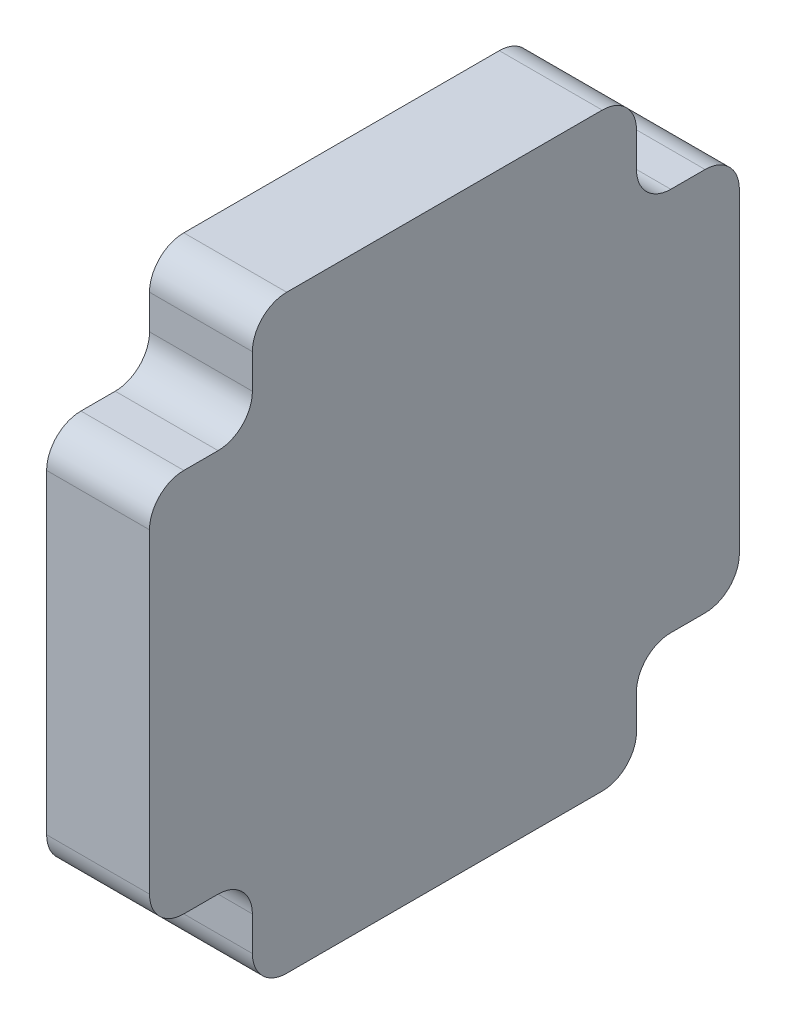
ISO-10303-21;
HEADER;
FILE_DESCRIPTION(('STEP AP214'),'2;1');
FILE_NAME('part.step','',(''),(''),'','','');
FILE_SCHEMA(('AUTOMOTIVE_DESIGN { 1 0 10303 214 1 1 1 1 }'));
ENDSEC;
DATA;
#1=APPLICATION_CONTEXT('core data for automotive mechanical design processes');
#2=APPLICATION_PROTOCOL_DEFINITION('international standard','automotive_design',2000,#1);
#3=PRODUCT_CONTEXT('',#1,'mechanical');
#4=PRODUCT('Part','Part','',(#3));
#5=PRODUCT_RELATED_PRODUCT_CATEGORY('part','',(#4));
#6=PRODUCT_DEFINITION_FORMATION('','',#4);
#7=PRODUCT_DEFINITION_CONTEXT('part definition',#1,'design');
#8=PRODUCT_DEFINITION('design','',#6,#7);
#9=PRODUCT_DEFINITION_SHAPE('','',#8);
#10=(LENGTH_UNIT() NAMED_UNIT(*) SI_UNIT(.MILLI.,.METRE.));
#11=(NAMED_UNIT(*) PLANE_ANGLE_UNIT() SI_UNIT($,.RADIAN.));
#12=(NAMED_UNIT(*) SI_UNIT($,.STERADIAN.) SOLID_ANGLE_UNIT());
#13=UNCERTAINTY_MEASURE_WITH_UNIT(LENGTH_MEASURE(1.E-05),#10,'distance_accuracy_value','');
#14=(GEOMETRIC_REPRESENTATION_CONTEXT(3) GLOBAL_UNCERTAINTY_ASSIGNED_CONTEXT((#13)) GLOBAL_UNIT_ASSIGNED_CONTEXT((#10,
#11,#12)) REPRESENTATION_CONTEXT('',''));
#15=CARTESIAN_POINT('',(0.,0.,0.));
#16=DIRECTION('',(0.,0.,1.));
#17=DIRECTION('',(1.,0.,0.));
#18=AXIS2_PLACEMENT_3D('',#15,#16,#17);
#19=CARTESIAN_POINT('',(15.,20.,-4.99999999999995));
#20=DIRECTION('',(-1.,0.,0.));
#21=DIRECTION('',(0.,0.,1.));
#22=AXIS2_PLACEMENT_3D('',#19,#20,#21);
#23=CYLINDRICAL_SURFACE('',#22,5.);
#24=CARTESIAN_POINT('',(0.,20.,-4.99999999999995));
#25=DIRECTION('',(1.,0.,0.));
#26=DIRECTION('',(0.,0.,1.));
#27=AXIS2_PLACEMENT_3D('',#24,#25,#26);
#28=CIRCLE('',#27,5.);
#29=CARTESIAN_POINT('',(0.,20.0000000000001,0.));
#30=VERTEX_POINT('',#29);
#31=CARTESIAN_POINT('',(0.,15.,-4.99999999999998));
#32=VERTEX_POINT('',#31);
#33=EDGE_CURVE('E224',#30,#32,#28,.T.);
#34=ORIENTED_EDGE('',*,*,#33,.T.);
#35=DIRECTION('',(-1.,0.,0.));
#36=VECTOR('',#35,1.);
#37=CARTESIAN_POINT('',(15.,15.,-4.99999999999998));
#38=LINE('',#37,#36);
#39=CARTESIAN_POINT('',(15.,15.,-4.99999999999998));
#40=VERTEX_POINT('',#39);
#41=EDGE_CURVE('E11',#40,#32,#38,.T.);
#42=ORIENTED_EDGE('',*,*,#41,.F.);
#43=CARTESIAN_POINT('',(15.,20.,-4.99999999999995));
#44=DIRECTION('',(1.,0.,0.));
#45=DIRECTION('',(0.,0.,1.));
#46=AXIS2_PLACEMENT_3D('',#43,#44,#45);
#47=CIRCLE('',#46,5.);
#48=CARTESIAN_POINT('',(15.,20.0000000000001,0.));
#49=VERTEX_POINT('',#48);
#50=EDGE_CURVE('E270',#49,#40,#47,.T.);
#51=ORIENTED_EDGE('',*,*,#50,.F.);
#52=DIRECTION('',(-1.,0.,0.));
#53=VECTOR('',#52,1.);
#54=CARTESIAN_POINT('',(15.,20.0000000000001,0.));
#55=LINE('',#54,#53);
#56=EDGE_CURVE('E220',#49,#30,#55,.T.);
#57=ORIENTED_EDGE('',*,*,#56,.T.);
#58=EDGE_LOOP('',(#34,#42,#51,#57));
#59=FACE_BOUND('',#58,.T.);
#60=ADVANCED_FACE('F32',(#59),#23,.T.);
#61=CARTESIAN_POINT('',(15.,15.,-4.99999999999998));
#62=DIRECTION('',(0.,1.,0.));
#63=DIRECTION('',(0.,0.,1.));
#64=AXIS2_PLACEMENT_3D('',#61,#62,#63);
#65=PLANE('',#64);
#66=DIRECTION('',(0.,0.,-1.));
#67=VECTOR('',#66,1.);
#68=CARTESIAN_POINT('',(0.,15.,-4.99999999999998));
#69=LINE('',#68,#67);
#70=CARTESIAN_POINT('',(0.,15.,-9.99999999999995));
#71=VERTEX_POINT('',#70);
#72=EDGE_CURVE('E227',#32,#71,#69,.T.);
#73=ORIENTED_EDGE('',*,*,#72,.T.);
#74=DIRECTION('',(-1.,0.,0.));
#75=VECTOR('',#74,1.);
#76=CARTESIAN_POINT('',(15.,15.,-9.99999999999995));
#77=LINE('',#76,#75);
#78=CARTESIAN_POINT('',(15.,15.,-9.99999999999995));
#79=VERTEX_POINT('',#78);
#80=EDGE_CURVE('E40',#79,#71,#77,.T.);
#81=ORIENTED_EDGE('',*,*,#80,.F.);
#82=DIRECTION('',(0.,0.,-1.));
#83=VECTOR('',#82,1.);
#84=CARTESIAN_POINT('',(15.,15.,-4.99999999999998));
#85=LINE('',#84,#83);
#86=EDGE_CURVE('E139',#40,#79,#85,.T.);
#87=ORIENTED_EDGE('',*,*,#86,.F.);
#88=ORIENTED_EDGE('',*,*,#41,.T.);
#89=EDGE_LOOP('',(#73,#81,#87,#88));
#90=FACE_BOUND('',#89,.T.);
#91=ADVANCED_FACE('F408',(#90),#65,.F.);
#92=CARTESIAN_POINT('',(15.,10.,-9.99999999999998));
#93=DIRECTION('',(-1.,0.,0.));
#94=DIRECTION('',(0.,0.,1.));
#95=AXIS2_PLACEMENT_3D('',#92,#93,#94);
#96=CYLINDRICAL_SURFACE('',#95,5.);
#97=CARTESIAN_POINT('',(0.,10.,-9.99999999999998));
#98=DIRECTION('',(-1.,0.,0.));
#99=DIRECTION('',(0.,0.,-1.));
#100=AXIS2_PLACEMENT_3D('',#97,#98,#99);
#101=CIRCLE('',#100,5.);
#102=CARTESIAN_POINT('',(0.,10.,-15.));
#103=VERTEX_POINT('',#102);
#104=EDGE_CURVE('E229',#71,#103,#101,.T.);
#105=ORIENTED_EDGE('',*,*,#104,.T.);
#106=DIRECTION('',(-1.,0.,0.));
#107=VECTOR('',#106,1.);
#108=CARTESIAN_POINT('',(15.,10.,-15.));
#109=LINE('',#108,#107);
#110=CARTESIAN_POINT('',(15.,10.,-15.));
#111=VERTEX_POINT('',#110);
#112=EDGE_CURVE('E325',#111,#103,#109,.T.);
#113=ORIENTED_EDGE('',*,*,#112,.F.);
#114=CARTESIAN_POINT('',(15.,10.,-9.99999999999998));
#115=DIRECTION('',(-1.,0.,0.));
#116=DIRECTION('',(0.,0.,-1.));
#117=AXIS2_PLACEMENT_3D('',#114,#115,#116);
#118=CIRCLE('',#117,5.);
#119=EDGE_CURVE('E333',#79,#111,#118,.T.);
#120=ORIENTED_EDGE('',*,*,#119,.F.);
#121=ORIENTED_EDGE('',*,*,#80,.T.);
#122=EDGE_LOOP('',(#105,#113,#120,#121));
#123=FACE_BOUND('',#122,.T.);
#124=ADVANCED_FACE('F331',(#123),#96,.F.);
#125=CARTESIAN_POINT('',(15.,10.,-15.));
#126=DIRECTION('',(0.,0.,-1.));
#127=DIRECTION('',(0.,1.,0.));
#128=AXIS2_PLACEMENT_3D('',#125,#126,#127);
#129=PLANE('',#128);
#130=DIRECTION('',(0.,-1.,0.));
#131=VECTOR('',#130,1.);
#132=CARTESIAN_POINT('',(0.,10.,-15.));
#133=LINE('',#132,#131);
#134=CARTESIAN_POINT('',(0.,5.00000000000005,-15.));
#135=VERTEX_POINT('',#134);
#136=EDGE_CURVE('E231',#103,#135,#133,.T.);
#137=ORIENTED_EDGE('',*,*,#136,.T.);
#138=DIRECTION('',(-1.,0.,0.));
#139=VECTOR('',#138,1.);
#140=CARTESIAN_POINT('',(15.,5.00000000000005,-15.));
#141=LINE('',#140,#139);
#142=CARTESIAN_POINT('',(15.,5.00000000000005,-15.));
#143=VERTEX_POINT('',#142);
#144=EDGE_CURVE('E322',#143,#135,#141,.T.);
#145=ORIENTED_EDGE('',*,*,#144,.F.);
#146=DIRECTION('',(0.,-1.,0.));
#147=VECTOR('',#146,1.);
#148=CARTESIAN_POINT('',(15.,10.,-15.));
#149=LINE('',#148,#147);
#150=EDGE_CURVE('E351',#111,#143,#149,.T.);
#151=ORIENTED_EDGE('',*,*,#150,.F.);
#152=ORIENTED_EDGE('',*,*,#112,.T.);
#153=EDGE_LOOP('',(#137,#145,#151,#152));
#154=FACE_BOUND('',#153,.T.);
#155=ADVANCED_FACE('F342',(#154),#129,.F.);
#156=CARTESIAN_POINT('',(15.,5.00000000000001,-20.));
#157=DIRECTION('',(-1.,0.,0.));
#158=DIRECTION('',(0.,0.,1.));
#159=AXIS2_PLACEMENT_3D('',#156,#157,#158);
#160=CYLINDRICAL_SURFACE('',#159,5.);
#161=CARTESIAN_POINT('',(0.,5.00000000000001,-20.));
#162=DIRECTION('',(1.,0.,0.));
#163=DIRECTION('',(0.,0.,-1.));
#164=AXIS2_PLACEMENT_3D('',#161,#162,#163);
#165=CIRCLE('',#164,5.);
#166=CARTESIAN_POINT('',(0.,0.,-20.));
#167=VERTEX_POINT('',#166);
#168=EDGE_CURVE('E233',#135,#167,#165,.T.);
#169=ORIENTED_EDGE('',*,*,#168,.T.);
#170=DIRECTION('',(-1.,0.,0.));
#171=VECTOR('',#170,1.);
#172=CARTESIAN_POINT('',(15.,0.,-20.));
#173=LINE('',#172,#171);
#174=CARTESIAN_POINT('',(15.,0.,-20.));
#175=VERTEX_POINT('',#174);
#176=EDGE_CURVE('E319',#175,#167,#173,.T.);
#177=ORIENTED_EDGE('',*,*,#176,.F.);
#178=CARTESIAN_POINT('',(15.,5.00000000000001,-20.));
#179=DIRECTION('',(1.,0.,0.));
#180=DIRECTION('',(0.,0.,-1.));
#181=AXIS2_PLACEMENT_3D('',#178,#179,#180);
#182=CIRCLE('',#181,5.);
#183=EDGE_CURVE('E348',#143,#175,#182,.T.);
#184=ORIENTED_EDGE('',*,*,#183,.F.);
#185=ORIENTED_EDGE('',*,*,#144,.T.);
#186=EDGE_LOOP('',(#169,#177,#184,#185));
#187=FACE_BOUND('',#186,.T.);
#188=ADVANCED_FACE('F346',(#187),#160,.T.);
#189=CARTESIAN_POINT('',(15.,0.,-20.));
#190=DIRECTION('',(0.,1.,0.));
#191=DIRECTION('',(0.,0.,1.));
#192=AXIS2_PLACEMENT_3D('',#189,#190,#191);
#193=PLANE('',#192);
#194=DIRECTION('',(0.,0.,-1.));
#195=VECTOR('',#194,1.);
#196=CARTESIAN_POINT('',(0.,0.,-20.));
#197=LINE('',#196,#195);
#198=CARTESIAN_POINT('',(0.,0.,-65.9999999999999));
#199=VERTEX_POINT('',#198);
#200=EDGE_CURVE('E235',#167,#199,#197,.T.);
#201=ORIENTED_EDGE('',*,*,#200,.T.);
#202=DIRECTION('',(-1.,0.,0.));
#203=VECTOR('',#202,1.);
#204=CARTESIAN_POINT('',(15.,0.,-65.9999999999999));
#205=LINE('',#204,#203);
#206=CARTESIAN_POINT('',(15.,0.,-65.9999999999999));
#207=VERTEX_POINT('',#206);
#208=EDGE_CURVE('E316',#207,#199,#205,.T.);
#209=ORIENTED_EDGE('',*,*,#208,.F.);
#210=DIRECTION('',(0.,0.,-1.));
#211=VECTOR('',#210,1.);
#212=CARTESIAN_POINT('',(15.,0.,-20.));
#213=LINE('',#212,#211);
#214=EDGE_CURVE('E350',#175,#207,#213,.T.);
#215=ORIENTED_EDGE('',*,*,#214,.F.);
#216=ORIENTED_EDGE('',*,*,#176,.T.);
#217=EDGE_LOOP('',(#201,#209,#215,#216));
#218=FACE_BOUND('',#217,.T.);
#219=ADVANCED_FACE('F421',(#218),#193,.F.);
#220=CARTESIAN_POINT('',(15.,4.99999999999999,-66.));
#221=DIRECTION('',(-1.,0.,0.));
#222=DIRECTION('',(0.,0.,1.));
#223=AXIS2_PLACEMENT_3D('',#220,#221,#222);
#224=CYLINDRICAL_SURFACE('',#223,5.);
#225=CARTESIAN_POINT('',(0.,4.99999999999999,-66.));
#226=DIRECTION('',(1.,0.,0.));
#227=DIRECTION('',(0.,0.,1.));
#228=AXIS2_PLACEMENT_3D('',#225,#226,#227);
#229=CIRCLE('',#228,5.);
#230=CARTESIAN_POINT('',(0.,5.00000000000002,-71.));
#231=VERTEX_POINT('',#230);
#232=EDGE_CURVE('E237',#199,#231,#229,.T.);
#233=ORIENTED_EDGE('',*,*,#232,.T.);
#234=DIRECTION('',(-1.,0.,0.));
#235=VECTOR('',#234,1.);
#236=CARTESIAN_POINT('',(15.,5.00000000000002,-71.));
#237=LINE('',#236,#235);
#238=CARTESIAN_POINT('',(15.,5.00000000000002,-71.));
#239=VERTEX_POINT('',#238);
#240=EDGE_CURVE('E313',#239,#231,#237,.T.);
#241=ORIENTED_EDGE('',*,*,#240,.F.);
#242=CARTESIAN_POINT('',(15.,4.99999999999999,-66.));
#243=DIRECTION('',(1.,0.,0.));
#244=DIRECTION('',(0.,0.,1.));
#245=AXIS2_PLACEMENT_3D('',#242,#243,#244);
#246=CIRCLE('',#245,5.);
#247=EDGE_CURVE('E353',#207,#239,#246,.T.);
#248=ORIENTED_EDGE('',*,*,#247,.F.);
#249=ORIENTED_EDGE('',*,*,#208,.T.);
#250=EDGE_LOOP('',(#233,#241,#248,#249));
#251=FACE_BOUND('',#250,.T.);
#252=ADVANCED_FACE('F424',(#251),#224,.T.);
#253=CARTESIAN_POINT('',(15.,5.00000000000002,-71.));
#254=DIRECTION('',(0.,0.,1.));
#255=DIRECTION('',(1.,0.,0.));
#256=AXIS2_PLACEMENT_3D('',#253,#254,#255);
#257=PLANE('',#256);
#258=DIRECTION('',(0.,1.,0.));
#259=VECTOR('',#258,1.);
#260=CARTESIAN_POINT('',(0.,5.00000000000002,-71.));
#261=LINE('',#260,#259);
#262=CARTESIAN_POINT('',(0.,9.99999999999995,-71.));
#263=VERTEX_POINT('',#262);
#264=EDGE_CURVE('E239',#231,#263,#261,.T.);
#265=ORIENTED_EDGE('',*,*,#264,.T.);
#266=DIRECTION('',(-1.,0.,0.));
#267=VECTOR('',#266,1.);
#268=CARTESIAN_POINT('',(15.,9.99999999999995,-71.));
#269=LINE('',#268,#267);
#270=CARTESIAN_POINT('',(15.,9.99999999999995,-71.));
#271=VERTEX_POINT('',#270);
#272=EDGE_CURVE('E310',#271,#263,#269,.T.);
#273=ORIENTED_EDGE('',*,*,#272,.F.);
#274=DIRECTION('',(0.,1.,0.));
#275=VECTOR('',#274,1.);
#276=CARTESIAN_POINT('',(15.,5.00000000000002,-71.));
#277=LINE('',#276,#275);
#278=EDGE_CURVE('E359',#239,#271,#277,.T.);
#279=ORIENTED_EDGE('',*,*,#278,.F.);
#280=ORIENTED_EDGE('',*,*,#240,.T.);
#281=EDGE_LOOP('',(#265,#273,#279,#280));
#282=FACE_BOUND('',#281,.T.);
#283=ADVANCED_FACE('F428',(#282),#257,.F.);
#284=CARTESIAN_POINT('',(15.,9.99999999999999,-76.));
#285=DIRECTION('',(-1.,0.,0.));
#286=DIRECTION('',(0.,0.,1.));
#287=AXIS2_PLACEMENT_3D('',#284,#285,#286);
#288=CYLINDRICAL_SURFACE('',#287,5.);
#289=CARTESIAN_POINT('',(0.,9.99999999999999,-76.));
#290=DIRECTION('',(-1.,0.,0.));
#291=DIRECTION('',(0.,0.,-1.));
#292=AXIS2_PLACEMENT_3D('',#289,#290,#291);
#293=CIRCLE('',#292,5.);
#294=CARTESIAN_POINT('',(0.,15.,-76.));
#295=VERTEX_POINT('',#294);
#296=EDGE_CURVE('E241',#263,#295,#293,.T.);
#297=ORIENTED_EDGE('',*,*,#296,.T.);
#298=DIRECTION('',(-1.,0.,0.));
#299=VECTOR('',#298,1.);
#300=CARTESIAN_POINT('',(15.,15.,-76.));
#301=LINE('',#300,#299);
#302=CARTESIAN_POINT('',(15.,15.,-76.));
#303=VERTEX_POINT('',#302);
#304=EDGE_CURVE('E307',#303,#295,#301,.T.);
#305=ORIENTED_EDGE('',*,*,#304,.F.);
#306=CARTESIAN_POINT('',(15.,9.99999999999999,-76.));
#307=DIRECTION('',(-1.,0.,0.));
#308=DIRECTION('',(0.,0.,-1.));
#309=AXIS2_PLACEMENT_3D('',#306,#307,#308);
#310=CIRCLE('',#309,5.);
#311=EDGE_CURVE('E361',#271,#303,#310,.T.);
#312=ORIENTED_EDGE('',*,*,#311,.F.);
#313=ORIENTED_EDGE('',*,*,#272,.T.);
#314=EDGE_LOOP('',(#297,#305,#312,#313));
#315=FACE_BOUND('',#314,.T.);
#316=ADVANCED_FACE('F432',(#315),#288,.F.);
#317=CARTESIAN_POINT('',(15.,15.,-76.));
#318=DIRECTION('',(0.,1.,0.));
#319=DIRECTION('',(0.,0.,1.));
#320=AXIS2_PLACEMENT_3D('',#317,#318,#319);
#321=PLANE('',#320);
#322=DIRECTION('',(0.,0.,-1.));
#323=VECTOR('',#322,1.);
#324=CARTESIAN_POINT('',(0.,15.,-76.));
#325=LINE('',#324,#323);
#326=CARTESIAN_POINT('',(0.,15.,-81.));
#327=VERTEX_POINT('',#326);
#328=EDGE_CURVE('E243',#295,#327,#325,.T.);
#329=ORIENTED_EDGE('',*,*,#328,.T.);
#330=DIRECTION('',(-1.,0.,0.));
#331=VECTOR('',#330,1.);
#332=CARTESIAN_POINT('',(15.,15.,-81.));
#333=LINE('',#332,#331);
#334=CARTESIAN_POINT('',(15.,15.,-81.));
#335=VERTEX_POINT('',#334);
#336=EDGE_CURVE('E304',#335,#327,#333,.T.);
#337=ORIENTED_EDGE('',*,*,#336,.F.);
#338=DIRECTION('',(0.,0.,-1.));
#339=VECTOR('',#338,1.);
#340=CARTESIAN_POINT('',(15.,15.,-76.));
#341=LINE('',#340,#339);
#342=EDGE_CURVE('E363',#303,#335,#341,.T.);
#343=ORIENTED_EDGE('',*,*,#342,.F.);
#344=ORIENTED_EDGE('',*,*,#304,.T.);
#345=EDGE_LOOP('',(#329,#337,#343,#344));
#346=FACE_BOUND('',#345,.T.);
#347=ADVANCED_FACE('F436',(#346),#321,.F.);
#348=CARTESIAN_POINT('',(15.,20.,-81.));
#349=DIRECTION('',(-1.,0.,0.));
#350=DIRECTION('',(0.,0.,1.));
#351=AXIS2_PLACEMENT_3D('',#348,#349,#350);
#352=CYLINDRICAL_SURFACE('',#351,5.);
#353=CARTESIAN_POINT('',(0.,20.,-81.));
#354=DIRECTION('',(1.,0.,0.));
#355=DIRECTION('',(0.,0.,-1.));
#356=AXIS2_PLACEMENT_3D('',#353,#354,#355);
#357=CIRCLE('',#356,5.);
#358=CARTESIAN_POINT('',(0.,20.,-86.));
#359=VERTEX_POINT('',#358);
#360=EDGE_CURVE('E245',#327,#359,#357,.T.);
#361=ORIENTED_EDGE('',*,*,#360,.T.);
#362=DIRECTION('',(-1.,0.,0.));
#363=VECTOR('',#362,1.);
#364=CARTESIAN_POINT('',(15.,20.,-86.));
#365=LINE('',#364,#363);
#366=CARTESIAN_POINT('',(15.,20.,-86.));
#367=VERTEX_POINT('',#366);
#368=EDGE_CURVE('E301',#367,#359,#365,.T.);
#369=ORIENTED_EDGE('',*,*,#368,.F.);
#370=CARTESIAN_POINT('',(15.,20.,-81.));
#371=DIRECTION('',(1.,0.,0.));
#372=DIRECTION('',(0.,0.,-1.));
#373=AXIS2_PLACEMENT_3D('',#370,#371,#372);
#374=CIRCLE('',#373,5.);
#375=EDGE_CURVE('E365',#335,#367,#374,.T.);
#376=ORIENTED_EDGE('',*,*,#375,.F.);
#377=ORIENTED_EDGE('',*,*,#336,.T.);
#378=EDGE_LOOP('',(#361,#369,#376,#377));
#379=FACE_BOUND('',#378,.T.);
#380=ADVANCED_FACE('F440',(#379),#352,.T.);
#381=CARTESIAN_POINT('',(15.,20.,-86.));
#382=DIRECTION('',(0.,0.,1.));
#383=DIRECTION('',(0.,-1.,0.));
#384=AXIS2_PLACEMENT_3D('',#381,#382,#383);
#385=PLANE('',#384);
#386=DIRECTION('',(0.,1.,0.));
#387=VECTOR('',#386,1.);
#388=CARTESIAN_POINT('',(0.,20.,-86.));
#389=LINE('',#388,#387);
#390=CARTESIAN_POINT('',(0.,65.9999999999999,-86.));
#391=VERTEX_POINT('',#390);
#392=EDGE_CURVE('E247',#359,#391,#389,.T.);
#393=ORIENTED_EDGE('',*,*,#392,.T.);
#394=DIRECTION('',(-1.,0.,0.));
#395=VECTOR('',#394,1.);
#396=CARTESIAN_POINT('',(15.,65.9999999999999,-86.));
#397=LINE('',#396,#395);
#398=CARTESIAN_POINT('',(15.,65.9999999999999,-86.));
#399=VERTEX_POINT('',#398);
#400=EDGE_CURVE('E298',#399,#391,#397,.T.);
#401=ORIENTED_EDGE('',*,*,#400,.F.);
#402=DIRECTION('',(0.,1.,0.));
#403=VECTOR('',#402,1.);
#404=CARTESIAN_POINT('',(15.,20.,-86.));
#405=LINE('',#404,#403);
#406=EDGE_CURVE('E367',#367,#399,#405,.T.);
#407=ORIENTED_EDGE('',*,*,#406,.F.);
#408=ORIENTED_EDGE('',*,*,#368,.T.);
#409=EDGE_LOOP('',(#393,#401,#407,#408));
#410=FACE_BOUND('',#409,.T.);
#411=ADVANCED_FACE('F444',(#410),#385,.F.);
#412=CARTESIAN_POINT('',(15.,65.9999999999999,-81.));
#413=DIRECTION('',(-1.,0.,0.));
#414=DIRECTION('',(0.,0.,1.));
#415=AXIS2_PLACEMENT_3D('',#412,#413,#414);
#416=CYLINDRICAL_SURFACE('',#415,5.);
#417=CARTESIAN_POINT('',(0.,65.9999999999999,-81.));
#418=DIRECTION('',(1.,0.,0.));
#419=DIRECTION('',(0.,0.,1.));
#420=AXIS2_PLACEMENT_3D('',#417,#418,#419);
#421=CIRCLE('',#420,5.);
#422=CARTESIAN_POINT('',(0.,71.,-81.));
#423=VERTEX_POINT('',#422);
#424=EDGE_CURVE('E249',#391,#423,#421,.T.);
#425=ORIENTED_EDGE('',*,*,#424,.T.);
#426=DIRECTION('',(-1.,0.,0.));
#427=VECTOR('',#426,1.);
#428=CARTESIAN_POINT('',(15.,71.,-81.));
#429=LINE('',#428,#427);
#430=CARTESIAN_POINT('',(15.,71.,-81.));
#431=VERTEX_POINT('',#430);
#432=EDGE_CURVE('E295',#431,#423,#429,.T.);
#433=ORIENTED_EDGE('',*,*,#432,.F.);
#434=CARTESIAN_POINT('',(15.,65.9999999999999,-81.));
#435=DIRECTION('',(1.,0.,0.));
#436=DIRECTION('',(0.,0.,1.));
#437=AXIS2_PLACEMENT_3D('',#434,#435,#436);
#438=CIRCLE('',#437,5.);
#439=EDGE_CURVE('E369',#399,#431,#438,.T.);
#440=ORIENTED_EDGE('',*,*,#439,.F.);
#441=ORIENTED_EDGE('',*,*,#400,.T.);
#442=EDGE_LOOP('',(#425,#433,#440,#441));
#443=FACE_BOUND('',#442,.T.);
#444=ADVANCED_FACE('F448',(#443),#416,.T.);
#445=CARTESIAN_POINT('',(15.,71.,-76.));
#446=DIRECTION('',(0.,-1.,0.));
#447=DIRECTION('',(0.,0.,-1.));
#448=AXIS2_PLACEMENT_3D('',#445,#446,#447);
#449=PLANE('',#448);
#450=DIRECTION('',(0.,0.,1.));
#451=VECTOR('',#450,1.);
#452=CARTESIAN_POINT('',(0.,71.,-76.));
#453=LINE('',#452,#451);
#454=CARTESIAN_POINT('',(0.,71.,-76.));
#455=VERTEX_POINT('',#454);
#456=EDGE_CURVE('E251',#423,#455,#453,.T.);
#457=ORIENTED_EDGE('',*,*,#456,.T.);
#458=DIRECTION('',(-1.,0.,0.));
#459=VECTOR('',#458,1.);
#460=CARTESIAN_POINT('',(15.,71.,-76.));
#461=LINE('',#460,#459);
#462=CARTESIAN_POINT('',(15.,71.,-76.));
#463=VERTEX_POINT('',#462);
#464=EDGE_CURVE('E292',#463,#455,#461,.T.);
#465=ORIENTED_EDGE('',*,*,#464,.F.);
#466=DIRECTION('',(0.,0.,1.));
#467=VECTOR('',#466,1.);
#468=CARTESIAN_POINT('',(15.,71.,-76.));
#469=LINE('',#468,#467);
#470=EDGE_CURVE('E371',#431,#463,#469,.T.);
#471=ORIENTED_EDGE('',*,*,#470,.F.);
#472=ORIENTED_EDGE('',*,*,#432,.T.);
#473=EDGE_LOOP('',(#457,#465,#471,#472));
#474=FACE_BOUND('',#473,.T.);
#475=ADVANCED_FACE('F452',(#474),#449,.F.);
#476=CARTESIAN_POINT('',(15.,76.,-76.));
#477=DIRECTION('',(-1.,0.,0.));
#478=DIRECTION('',(0.,0.,1.));
#479=AXIS2_PLACEMENT_3D('',#476,#477,#478);
#480=CYLINDRICAL_SURFACE('',#479,5.);
#481=CARTESIAN_POINT('',(0.,76.,-76.));
#482=DIRECTION('',(-1.,0.,0.));
#483=DIRECTION('',(0.,0.,-1.));
#484=AXIS2_PLACEMENT_3D('',#481,#482,#483);
#485=CIRCLE('',#484,5.);
#486=CARTESIAN_POINT('',(0.,76.,-71.));
#487=VERTEX_POINT('',#486);
#488=EDGE_CURVE('E253',#455,#487,#485,.T.);
#489=ORIENTED_EDGE('',*,*,#488,.T.);
#490=DIRECTION('',(-1.,0.,0.));
#491=VECTOR('',#490,1.);
#492=CARTESIAN_POINT('',(15.,76.,-71.));
#493=LINE('',#492,#491);
#494=CARTESIAN_POINT('',(15.,76.,-71.));
#495=VERTEX_POINT('',#494);
#496=EDGE_CURVE('E289',#495,#487,#493,.T.);
#497=ORIENTED_EDGE('',*,*,#496,.F.);
#498=CARTESIAN_POINT('',(15.,76.,-76.));
#499=DIRECTION('',(-1.,0.,0.));
#500=DIRECTION('',(0.,0.,-1.));
#501=AXIS2_PLACEMENT_3D('',#498,#499,#500);
#502=CIRCLE('',#501,5.);
#503=EDGE_CURVE('E373',#463,#495,#502,.T.);
#504=ORIENTED_EDGE('',*,*,#503,.F.);
#505=ORIENTED_EDGE('',*,*,#464,.T.);
#506=EDGE_LOOP('',(#489,#497,#504,#505));
#507=FACE_BOUND('',#506,.T.);
#508=ADVANCED_FACE('F456',(#507),#480,.F.);
#509=CARTESIAN_POINT('',(15.,80.9999999999999,-71.));
#510=DIRECTION('',(0.,0.,1.));
#511=DIRECTION('',(1.,0.,0.));
#512=AXIS2_PLACEMENT_3D('',#509,#510,#511);
#513=PLANE('',#512);
#514=DIRECTION('',(0.,1.,0.));
#515=VECTOR('',#514,1.);
#516=CARTESIAN_POINT('',(0.,80.9999999999999,-71.));
#517=LINE('',#516,#515);
#518=CARTESIAN_POINT('',(0.,80.9999999999999,-71.));
#519=VERTEX_POINT('',#518);
#520=EDGE_CURVE('E255',#487,#519,#517,.T.);
#521=ORIENTED_EDGE('',*,*,#520,.T.);
#522=DIRECTION('',(-1.,0.,0.));
#523=VECTOR('',#522,1.);
#524=CARTESIAN_POINT('',(15.,80.9999999999999,-71.));
#525=LINE('',#524,#523);
#526=CARTESIAN_POINT('',(15.,80.9999999999999,-71.));
#527=VERTEX_POINT('',#526);
#528=EDGE_CURVE('E286',#527,#519,#525,.T.);
#529=ORIENTED_EDGE('',*,*,#528,.F.);
#530=DIRECTION('',(0.,1.,0.));
#531=VECTOR('',#530,1.);
#532=CARTESIAN_POINT('',(15.,80.9999999999999,-71.));
#533=LINE('',#532,#531);
#534=EDGE_CURVE('E375',#495,#527,#533,.T.);
#535=ORIENTED_EDGE('',*,*,#534,.F.);
#536=ORIENTED_EDGE('',*,*,#496,.T.);
#537=EDGE_LOOP('',(#521,#529,#535,#536));
#538=FACE_BOUND('',#537,.T.);
#539=ADVANCED_FACE('F460',(#538),#513,.F.);
#540=CARTESIAN_POINT('',(15.,81.,-66.));
#541=DIRECTION('',(-1.,0.,0.));
#542=DIRECTION('',(0.,0.,1.));
#543=AXIS2_PLACEMENT_3D('',#540,#541,#542);
#544=CYLINDRICAL_SURFACE('',#543,5.);
#545=CARTESIAN_POINT('',(0.,81.,-66.));
#546=DIRECTION('',(1.,0.,0.));
#547=DIRECTION('',(0.,0.,-1.));
#548=AXIS2_PLACEMENT_3D('',#545,#546,#547);
#549=CIRCLE('',#548,5.);
#550=CARTESIAN_POINT('',(0.,86.,-65.9999999999999));
#551=VERTEX_POINT('',#550);
#552=EDGE_CURVE('E257',#519,#551,#549,.T.);
#553=ORIENTED_EDGE('',*,*,#552,.T.);
#554=DIRECTION('',(-1.,0.,0.));
#555=VECTOR('',#554,1.);
#556=CARTESIAN_POINT('',(15.,86.,-65.9999999999999));
#557=LINE('',#556,#555);
#558=CARTESIAN_POINT('',(15.,86.,-65.9999999999999));
#559=VERTEX_POINT('',#558);
#560=EDGE_CURVE('E283',#559,#551,#557,.T.);
#561=ORIENTED_EDGE('',*,*,#560,.F.);
#562=CARTESIAN_POINT('',(15.,81.,-66.));
#563=DIRECTION('',(1.,0.,0.));
#564=DIRECTION('',(0.,0.,-1.));
#565=AXIS2_PLACEMENT_3D('',#562,#563,#564);
#566=CIRCLE('',#565,5.);
#567=EDGE_CURVE('E377',#527,#559,#566,.T.);
#568=ORIENTED_EDGE('',*,*,#567,.F.);
#569=ORIENTED_EDGE('',*,*,#528,.T.);
#570=EDGE_LOOP('',(#553,#561,#568,#569));
#571=FACE_BOUND('',#570,.T.);
#572=ADVANCED_FACE('F464',(#571),#544,.T.);
#573=CARTESIAN_POINT('',(15.,86.,-20.));
#574=DIRECTION('',(0.,-1.,0.));
#575=DIRECTION('',(0.,0.,-1.));
#576=AXIS2_PLACEMENT_3D('',#573,#574,#575);
#577=PLANE('',#576);
#578=DIRECTION('',(0.,0.,1.));
#579=VECTOR('',#578,1.);
#580=CARTESIAN_POINT('',(0.,86.,-20.));
#581=LINE('',#580,#579);
#582=CARTESIAN_POINT('',(0.,86.,-20.));
#583=VERTEX_POINT('',#582);
#584=EDGE_CURVE('E259',#551,#583,#581,.T.);
#585=ORIENTED_EDGE('',*,*,#584,.T.);
#586=DIRECTION('',(-1.,0.,0.));
#587=VECTOR('',#586,1.);
#588=CARTESIAN_POINT('',(15.,86.,-20.));
#589=LINE('',#588,#587);
#590=CARTESIAN_POINT('',(15.,86.,-20.));
#591=VERTEX_POINT('',#590);
#592=EDGE_CURVE('E280',#591,#583,#589,.T.);
#593=ORIENTED_EDGE('',*,*,#592,.F.);
#594=DIRECTION('',(0.,0.,1.));
#595=VECTOR('',#594,1.);
#596=CARTESIAN_POINT('',(15.,86.,-20.));
#597=LINE('',#596,#595);
#598=EDGE_CURVE('E379',#559,#591,#597,.T.);
#599=ORIENTED_EDGE('',*,*,#598,.F.);
#600=ORIENTED_EDGE('',*,*,#560,.T.);
#601=EDGE_LOOP('',(#585,#593,#599,#600));
#602=FACE_BOUND('',#601,.T.);
#603=ADVANCED_FACE('F468',(#602),#577,.F.);
#604=CARTESIAN_POINT('',(15.,81.,-20.));
#605=DIRECTION('',(-1.,0.,0.));
#606=DIRECTION('',(0.,0.,1.));
#607=AXIS2_PLACEMENT_3D('',#604,#605,#606);
#608=CYLINDRICAL_SURFACE('',#607,5.);
#609=CARTESIAN_POINT('',(0.,81.,-20.));
#610=DIRECTION('',(1.,0.,0.));
#611=DIRECTION('',(0.,0.,1.));
#612=AXIS2_PLACEMENT_3D('',#609,#610,#611);
#613=CIRCLE('',#612,5.);
#614=CARTESIAN_POINT('',(0.,81.,-15.));
#615=VERTEX_POINT('',#614);
#616=EDGE_CURVE('E261',#583,#615,#613,.T.);
#617=ORIENTED_EDGE('',*,*,#616,.T.);
#618=DIRECTION('',(-1.,0.,0.));
#619=VECTOR('',#618,1.);
#620=CARTESIAN_POINT('',(15.,81.,-15.));
#621=LINE('',#620,#619);
#622=CARTESIAN_POINT('',(15.,81.,-15.));
#623=VERTEX_POINT('',#622);
#624=EDGE_CURVE('E277',#623,#615,#621,.T.);
#625=ORIENTED_EDGE('',*,*,#624,.F.);
#626=CARTESIAN_POINT('',(15.,81.,-20.));
#627=DIRECTION('',(1.,0.,0.));
#628=DIRECTION('',(0.,0.,1.));
#629=AXIS2_PLACEMENT_3D('',#626,#627,#628);
#630=CIRCLE('',#629,5.);
#631=EDGE_CURVE('E381',#591,#623,#630,.T.);
#632=ORIENTED_EDGE('',*,*,#631,.F.);
#633=ORIENTED_EDGE('',*,*,#592,.T.);
#634=EDGE_LOOP('',(#617,#625,#632,#633));
#635=FACE_BOUND('',#634,.T.);
#636=ADVANCED_FACE('F472',(#635),#608,.T.);
#637=CARTESIAN_POINT('',(15.,76.,-15.));
#638=DIRECTION('',(0.,0.,-1.));
#639=DIRECTION('',(-1.,0.,0.));
#640=AXIS2_PLACEMENT_3D('',#637,#638,#639);
#641=PLANE('',#640);
#642=DIRECTION('',(0.,-1.,0.));
#643=VECTOR('',#642,1.);
#644=CARTESIAN_POINT('',(0.,76.,-15.));
#645=LINE('',#644,#643);
#646=CARTESIAN_POINT('',(0.,76.,-15.));
#647=VERTEX_POINT('',#646);
#648=EDGE_CURVE('E263',#615,#647,#645,.T.);
#649=ORIENTED_EDGE('',*,*,#648,.T.);
#650=DIRECTION('',(-1.,0.,0.));
#651=VECTOR('',#650,1.);
#652=CARTESIAN_POINT('',(15.,76.,-15.));
#653=LINE('',#652,#651);
#654=CARTESIAN_POINT('',(15.,76.,-15.));
#655=VERTEX_POINT('',#654);
#656=EDGE_CURVE('E274',#655,#647,#653,.T.);
#657=ORIENTED_EDGE('',*,*,#656,.F.);
#658=DIRECTION('',(0.,-1.,0.));
#659=VECTOR('',#658,1.);
#660=CARTESIAN_POINT('',(15.,76.,-15.));
#661=LINE('',#660,#659);
#662=EDGE_CURVE('E383',#623,#655,#661,.T.);
#663=ORIENTED_EDGE('',*,*,#662,.F.);
#664=ORIENTED_EDGE('',*,*,#624,.T.);
#665=EDGE_LOOP('',(#649,#657,#663,#664));
#666=FACE_BOUND('',#665,.T.);
#667=ADVANCED_FACE('F389',(#666),#641,.F.);
#668=CARTESIAN_POINT('',(15.,75.9999999999999,-10.));
#669=DIRECTION('',(-1.,0.,0.));
#670=DIRECTION('',(0.,0.,1.));
#671=AXIS2_PLACEMENT_3D('',#668,#669,#670);
#672=CYLINDRICAL_SURFACE('',#671,5.);
#673=CARTESIAN_POINT('',(0.,75.9999999999999,-10.));
#674=DIRECTION('',(-1.,0.,0.));
#675=DIRECTION('',(0.,0.,-1.));
#676=AXIS2_PLACEMENT_3D('',#673,#674,#675);
#677=CIRCLE('',#676,5.);
#678=CARTESIAN_POINT('',(0.,70.9999999999999,-9.99999999999996));
#679=VERTEX_POINT('',#678);
#680=EDGE_CURVE('E265',#647,#679,#677,.T.);
#681=ORIENTED_EDGE('',*,*,#680,.T.);
#682=DIRECTION('',(-1.,0.,0.));
#683=VECTOR('',#682,1.);
#684=CARTESIAN_POINT('',(15.,70.9999999999999,-9.99999999999996));
#685=LINE('',#684,#683);
#686=CARTESIAN_POINT('',(15.,70.9999999999999,-9.99999999999996));
#687=VERTEX_POINT('',#686);
#688=EDGE_CURVE('E215',#687,#679,#685,.T.);
#689=ORIENTED_EDGE('',*,*,#688,.F.);
#690=CARTESIAN_POINT('',(15.,75.9999999999999,-10.));
#691=DIRECTION('',(-1.,0.,0.));
#692=DIRECTION('',(0.,0.,-1.));
#693=AXIS2_PLACEMENT_3D('',#690,#691,#692);
#694=CIRCLE('',#693,5.);
#695=EDGE_CURVE('E206',#655,#687,#694,.T.);
#696=ORIENTED_EDGE('',*,*,#695,.F.);
#697=ORIENTED_EDGE('',*,*,#656,.T.);
#698=EDGE_LOOP('',(#681,#689,#696,#697));
#699=FACE_BOUND('',#698,.T.);
#700=ADVANCED_FACE('F393',(#699),#672,.F.);
#701=CARTESIAN_POINT('',(15.,70.9999999999999,-5.00000000000003));
#702=DIRECTION('',(0.,-1.,0.));
#703=DIRECTION('',(0.,0.,-1.));
#704=AXIS2_PLACEMENT_3D('',#701,#702,#703);
#705=PLANE('',#704);
#706=DIRECTION('',(0.,0.,1.));
#707=VECTOR('',#706,1.);
#708=CARTESIAN_POINT('',(0.,70.9999999999999,-5.00000000000003));
#709=LINE('',#708,#707);
#710=CARTESIAN_POINT('',(0.,70.9999999999999,-5.00000000000003));
#711=VERTEX_POINT('',#710);
#712=EDGE_CURVE('E214',#679,#711,#709,.T.);
#713=ORIENTED_EDGE('',*,*,#712,.T.);
#714=DIRECTION('',(-1.,0.,0.));
#715=VECTOR('',#714,1.);
#716=CARTESIAN_POINT('',(15.,70.9999999999999,-5.00000000000003));
#717=LINE('',#716,#715);
#718=CARTESIAN_POINT('',(15.,70.9999999999999,-5.00000000000003));
#719=VERTEX_POINT('',#718);
#720=EDGE_CURVE('E211',#719,#711,#717,.T.);
#721=ORIENTED_EDGE('',*,*,#720,.F.);
#722=DIRECTION('',(0.,0.,1.));
#723=VECTOR('',#722,1.);
#724=CARTESIAN_POINT('',(15.,70.9999999999999,-5.00000000000003));
#725=LINE('',#724,#723);
#726=EDGE_CURVE('E200',#687,#719,#725,.T.);
#727=ORIENTED_EDGE('',*,*,#726,.F.);
#728=ORIENTED_EDGE('',*,*,#688,.T.);
#729=EDGE_LOOP('',(#713,#721,#727,#728));
#730=FACE_BOUND('',#729,.T.);
#731=ADVANCED_FACE('F212',(#730),#705,.F.);
#732=CARTESIAN_POINT('',(15.,65.9999999999999,-5.));
#733=DIRECTION('',(-1.,0.,0.));
#734=DIRECTION('',(0.,0.,1.));
#735=AXIS2_PLACEMENT_3D('',#732,#733,#734);
#736=CYLINDRICAL_SURFACE('',#735,5.);
#737=CARTESIAN_POINT('',(0.,65.9999999999999,-5.));
#738=DIRECTION('',(1.,0.,0.));
#739=DIRECTION('',(0.,0.,-1.));
#740=AXIS2_PLACEMENT_3D('',#737,#738,#739);
#741=CIRCLE('',#740,5.);
#742=CARTESIAN_POINT('',(0.,65.9999999999999,0.));
#743=VERTEX_POINT('',#742);
#744=EDGE_CURVE('E125',#711,#743,#741,.T.);
#745=ORIENTED_EDGE('',*,*,#744,.T.);
#746=DIRECTION('',(-1.,0.,0.));
#747=VECTOR('',#746,1.);
#748=CARTESIAN_POINT('',(15.,65.9999999999999,0.));
#749=LINE('',#748,#747);
#750=CARTESIAN_POINT('',(15.,65.9999999999999,0.));
#751=VERTEX_POINT('',#750);
#752=EDGE_CURVE('E216',#751,#743,#749,.T.);
#753=ORIENTED_EDGE('',*,*,#752,.F.);
#754=CARTESIAN_POINT('',(15.,65.9999999999999,-5.));
#755=DIRECTION('',(1.,0.,0.));
#756=DIRECTION('',(0.,0.,-1.));
#757=AXIS2_PLACEMENT_3D('',#754,#755,#756);
#758=CIRCLE('',#757,5.);
#759=EDGE_CURVE('E204',#719,#751,#758,.T.);
#760=ORIENTED_EDGE('',*,*,#759,.F.);
#761=ORIENTED_EDGE('',*,*,#720,.T.);
#762=EDGE_LOOP('',(#745,#753,#760,#761));
#763=FACE_BOUND('',#762,.T.);
#764=ADVANCED_FACE('F218',(#763),#736,.T.);
#765=CARTESIAN_POINT('',(15.,20.0000000000001,0.));
#766=DIRECTION('',(0.,0.,-1.));
#767=DIRECTION('',(0.,1.,0.));
#768=AXIS2_PLACEMENT_3D('',#765,#766,#767);
#769=PLANE('',#768);
#770=DIRECTION('',(0.,-1.,0.));
#771=VECTOR('',#770,1.);
#772=CARTESIAN_POINT('',(0.,20.0000000000001,0.));
#773=LINE('',#772,#771);
#774=EDGE_CURVE('E131',#743,#30,#773,.T.);
#775=ORIENTED_EDGE('',*,*,#774,.T.);
#776=ORIENTED_EDGE('',*,*,#56,.F.);
#777=DIRECTION('',(0.,-1.,0.));
#778=VECTOR('',#777,1.);
#779=CARTESIAN_POINT('',(15.,20.0000000000001,0.));
#780=LINE('',#779,#778);
#781=EDGE_CURVE('E48',#751,#49,#780,.T.);
#782=ORIENTED_EDGE('',*,*,#781,.F.);
#783=ORIENTED_EDGE('',*,*,#752,.T.);
#784=EDGE_LOOP('',(#775,#776,#782,#783));
#785=FACE_BOUND('',#784,.T.);
#786=ADVANCED_FACE('F397',(#785),#769,.F.);
#787=CARTESIAN_POINT('',(15.,20.,-4.99999999999995));
#788=DIRECTION('',(-1.,0.,0.));
#789=DIRECTION('',(0.,0.,1.));
#790=AXIS2_PLACEMENT_3D('',#787,#788,#789);
#791=PLANE('',#790);
#792=ORIENTED_EDGE('',*,*,#50,.T.);
#793=ORIENTED_EDGE('',*,*,#86,.T.);
#794=ORIENTED_EDGE('',*,*,#119,.T.);
#795=ORIENTED_EDGE('',*,*,#150,.T.);
#796=ORIENTED_EDGE('',*,*,#183,.T.);
#797=ORIENTED_EDGE('',*,*,#214,.T.);
#798=ORIENTED_EDGE('',*,*,#247,.T.);
#799=ORIENTED_EDGE('',*,*,#278,.T.);
#800=ORIENTED_EDGE('',*,*,#311,.T.);
#801=ORIENTED_EDGE('',*,*,#342,.T.);
#802=ORIENTED_EDGE('',*,*,#375,.T.);
#803=ORIENTED_EDGE('',*,*,#406,.T.);
#804=ORIENTED_EDGE('',*,*,#439,.T.);
#805=ORIENTED_EDGE('',*,*,#470,.T.);
#806=ORIENTED_EDGE('',*,*,#503,.T.);
#807=ORIENTED_EDGE('',*,*,#534,.T.);
#808=ORIENTED_EDGE('',*,*,#567,.T.);
#809=ORIENTED_EDGE('',*,*,#598,.T.);
#810=ORIENTED_EDGE('',*,*,#631,.T.);
#811=ORIENTED_EDGE('',*,*,#662,.T.);
#812=ORIENTED_EDGE('',*,*,#695,.T.);
#813=ORIENTED_EDGE('',*,*,#726,.T.);
#814=ORIENTED_EDGE('',*,*,#759,.T.);
#815=ORIENTED_EDGE('',*,*,#781,.T.);
#816=EDGE_LOOP('',(#792,#793,#794,#795,#796,#797,#798,#799,#800,#801,#802,#803,#804,#805,#806,
#807,#808,#809,#810,#811,#812,#813,#814,#815));
#817=FACE_BOUND('',#816,.T.);
#818=ADVANCED_FACE('F202',(#817),#791,.F.);
#819=CARTESIAN_POINT('',(0.,20.,-4.99999999999995));
#820=DIRECTION('',(-1.,0.,0.));
#821=DIRECTION('',(0.,0.,1.));
#822=AXIS2_PLACEMENT_3D('',#819,#820,#821);
#823=PLANE('',#822);
#824=ORIENTED_EDGE('',*,*,#33,.F.);
#825=ORIENTED_EDGE('',*,*,#774,.F.);
#826=ORIENTED_EDGE('',*,*,#744,.F.);
#827=ORIENTED_EDGE('',*,*,#712,.F.);
#828=ORIENTED_EDGE('',*,*,#680,.F.);
#829=ORIENTED_EDGE('',*,*,#648,.F.);
#830=ORIENTED_EDGE('',*,*,#616,.F.);
#831=ORIENTED_EDGE('',*,*,#584,.F.);
#832=ORIENTED_EDGE('',*,*,#552,.F.);
#833=ORIENTED_EDGE('',*,*,#520,.F.);
#834=ORIENTED_EDGE('',*,*,#488,.F.);
#835=ORIENTED_EDGE('',*,*,#456,.F.);
#836=ORIENTED_EDGE('',*,*,#424,.F.);
#837=ORIENTED_EDGE('',*,*,#392,.F.);
#838=ORIENTED_EDGE('',*,*,#360,.F.);
#839=ORIENTED_EDGE('',*,*,#328,.F.);
#840=ORIENTED_EDGE('',*,*,#296,.F.);
#841=ORIENTED_EDGE('',*,*,#264,.F.);
#842=ORIENTED_EDGE('',*,*,#232,.F.);
#843=ORIENTED_EDGE('',*,*,#200,.F.);
#844=ORIENTED_EDGE('',*,*,#168,.F.);
#845=ORIENTED_EDGE('',*,*,#136,.F.);
#846=ORIENTED_EDGE('',*,*,#104,.F.);
#847=ORIENTED_EDGE('',*,*,#72,.F.);
#848=EDGE_LOOP('',(#824,#825,#826,#827,#828,#829,#830,#831,#832,#833,#834,#835,#836,#837,#838,
#839,#840,#841,#842,#843,#844,#845,#846,#847));
#849=FACE_BOUND('',#848,.T.);
#850=ADVANCED_FACE('F337',(#849),#823,.T.);
#851=CLOSED_SHELL('',(#60,#91,#124,#155,#188,#219,#252,#283,#316,#347,#380,#411,#444,#475,#508,
#539,#572,#603,#636,#667,#700,#731,#764,#786,#818,#850));
#852=MANIFOLD_SOLID_BREP('B2',#851);
#853=ADVANCED_BREP_SHAPE_REPRESENTATION('',(#18,#852),#14);
#854=SHAPE_DEFINITION_REPRESENTATION(#9,#853);
ENDSEC;
END-ISO-10303-21;
